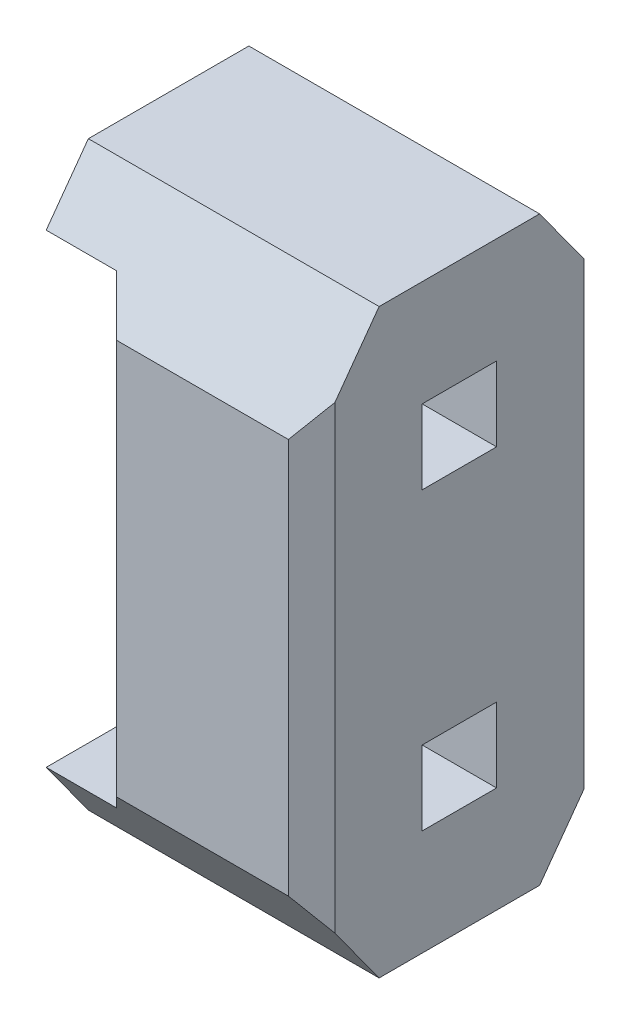
ISO-10303-21;
HEADER;
FILE_DESCRIPTION(('STEP AP214'),'2;1');
FILE_NAME('part.step','',(''),(''),'','','');
FILE_SCHEMA(('AUTOMOTIVE_DESIGN { 1 0 10303 214 1 1 1 1 }'));
ENDSEC;
DATA;
#1=APPLICATION_CONTEXT('core data for automotive mechanical design processes');
#2=APPLICATION_PROTOCOL_DEFINITION('international standard','automotive_design',2000,#1);
#3=PRODUCT_CONTEXT('',#1,'mechanical');
#4=PRODUCT('Part','Part','',(#3));
#5=PRODUCT_RELATED_PRODUCT_CATEGORY('part','',(#4));
#6=PRODUCT_DEFINITION_FORMATION('','',#4);
#7=PRODUCT_DEFINITION_CONTEXT('part definition',#1,'design');
#8=PRODUCT_DEFINITION('design','',#6,#7);
#9=PRODUCT_DEFINITION_SHAPE('','',#8);
#10=(LENGTH_UNIT() NAMED_UNIT(*) SI_UNIT(.MILLI.,.METRE.));
#11=(NAMED_UNIT(*) PLANE_ANGLE_UNIT() SI_UNIT($,.RADIAN.));
#12=(NAMED_UNIT(*) SI_UNIT($,.STERADIAN.) SOLID_ANGLE_UNIT());
#13=UNCERTAINTY_MEASURE_WITH_UNIT(LENGTH_MEASURE(1.E-05),#10,'distance_accuracy_value','');
#14=(GEOMETRIC_REPRESENTATION_CONTEXT(3) GLOBAL_UNCERTAINTY_ASSIGNED_CONTEXT((#13)) GLOBAL_UNIT_ASSIGNED_CONTEXT((#10,
#11,#12)) REPRESENTATION_CONTEXT('',''));
#15=CARTESIAN_POINT('',(0.,0.,0.));
#16=DIRECTION('',(0.,0.,1.));
#17=DIRECTION('',(1.,0.,0.));
#18=AXIS2_PLACEMENT_3D('',#15,#16,#17);
#19=CARTESIAN_POINT('',(1.25,4.6,-43.47));
#20=DIRECTION('',(0.,0.586967571460905,0.809610443394407));
#21=DIRECTION('',(0.,-0.809610443394407,0.586967571460905));
#22=AXIS2_PLACEMENT_3D('',#19,#20,#21);
#23=PLANE('',#22);
#24=DIRECTION('',(1.,0.,0.));
#25=VECTOR('',#24,1.);
#26=CARTESIAN_POINT('',(1.25,4.5,-43.3975));
#27=LINE('',#26,#25);
#28=CARTESIAN_POINT('',(0.,4.5,-43.3975));
#29=VERTEX_POINT('',#28);
#30=CARTESIAN_POINT('',(0.602500000000326,4.5,-43.3975000000001));
#31=VERTEX_POINT('',#30);
#32=EDGE_CURVE('E199',#29,#31,#27,.T.);
#33=ORIENTED_EDGE('',*,*,#32,.T.);
#34=DIRECTION('',(0.506207656348699,-0.698217457033982,0.506207656349603));
#35=VECTOR('',#34,1.);
#36=CARTESIAN_POINT('',(0.6025000000002,4.5,-43.3975));
#37=LINE('',#36,#35);
#38=CARTESIAN_POINT('',(0.819999999999671,4.2,-43.1799999999999));
#39=VERTEX_POINT('',#38);
#40=EDGE_CURVE('E197',#31,#39,#37,.T.);
#41=ORIENTED_EDGE('',*,*,#40,.T.);
#42=DIRECTION('',(1.,0.,0.));
#43=VECTOR('',#42,1.);
#44=CARTESIAN_POINT('',(1.25,4.19999999999999,-43.18));
#45=LINE('',#44,#43);
#46=CARTESIAN_POINT('',(2.30000000000012,4.2,-43.1799999999999));
#47=VERTEX_POINT('',#46);
#48=EDGE_CURVE('E20',#39,#47,#45,.T.);
#49=ORIENTED_EDGE('',*,*,#48,.T.);
#50=DIRECTION('',(0.506207656348957,0.698217457033858,-0.506207656349515));
#51=VECTOR('',#50,1.);
#52=CARTESIAN_POINT('',(2.3,4.19999999999999,-43.18));
#53=LINE('',#52,#51);
#54=CARTESIAN_POINT('',(2.49999999999988,4.47586206896592,-43.3800000000002));
#55=VERTEX_POINT('',#54);
#56=EDGE_CURVE('E181',#47,#55,#53,.T.);
#57=ORIENTED_EDGE('',*,*,#56,.T.);
#58=DIRECTION('',(0.,-0.809610443394407,0.586967571460905));
#59=VECTOR('',#58,1.);
#60=CARTESIAN_POINT('',(2.5,4.6,-43.47));
#61=LINE('',#60,#59);
#62=CARTESIAN_POINT('',(2.5,5.,-43.76));
#63=VERTEX_POINT('',#62);
#64=EDGE_CURVE('E188',#55,#63,#61,.F.);
#65=ORIENTED_EDGE('',*,*,#64,.T.);
#66=DIRECTION('',(1.,0.,0.));
#67=VECTOR('',#66,1.);
#68=CARTESIAN_POINT('',(1.25,5.,-43.76));
#69=LINE('',#68,#67);
#70=CARTESIAN_POINT('',(0.,5.,-43.76));
#71=VERTEX_POINT('',#70);
#72=EDGE_CURVE('E215',#71,#63,#69,.T.);
#73=ORIENTED_EDGE('',*,*,#72,.F.);
#74=DIRECTION('',(0.,-0.809610443394407,0.586967571460905));
#75=VECTOR('',#74,1.);
#76=CARTESIAN_POINT('',(0.,4.6,-43.47));
#77=LINE('',#76,#75);
#78=EDGE_CURVE('E207',#71,#29,#77,.T.);
#79=ORIENTED_EDGE('',*,*,#78,.T.);
#80=EDGE_LOOP('',(#33,#41,#49,#57,#65,#73,#79));
#81=FACE_BOUND('',#80,.T.);
#82=ADVANCED_FACE('F17',(#81),#23,.T.);
#83=CARTESIAN_POINT('',(1.25,4.6,-45.43));
#84=DIRECTION('',(0.,-0.586967571460905,0.809610443394407));
#85=DIRECTION('',(0.,-0.809610443394407,-0.586967571460905));
#86=AXIS2_PLACEMENT_3D('',#83,#84,#85);
#87=PLANE('',#86);
#88=DIRECTION('',(0.,-0.809610443394407,-0.586967571460905));
#89=VECTOR('',#88,1.);
#90=CARTESIAN_POINT('',(0.,4.6,-45.43));
#91=LINE('',#90,#89);
#92=CARTESIAN_POINT('',(0.,5.,-45.14));
#93=VERTEX_POINT('',#92);
#94=CARTESIAN_POINT('',(0.,4.5,-45.5025));
#95=VERTEX_POINT('',#94);
#96=EDGE_CURVE('E263',#93,#95,#91,.T.);
#97=ORIENTED_EDGE('',*,*,#96,.F.);
#98=DIRECTION('',(1.,0.,0.));
#99=VECTOR('',#98,1.);
#100=CARTESIAN_POINT('',(1.25,5.,-45.14));
#101=LINE('',#100,#99);
#102=CARTESIAN_POINT('',(2.5,5.,-45.14));
#103=VERTEX_POINT('',#102);
#104=EDGE_CURVE('E227',#103,#93,#101,.F.);
#105=ORIENTED_EDGE('',*,*,#104,.F.);
#106=DIRECTION('',(0.,-0.809610443394407,-0.586967571460905));
#107=VECTOR('',#106,1.);
#108=CARTESIAN_POINT('',(2.5,4.6,-45.43));
#109=LINE('',#108,#107);
#110=CARTESIAN_POINT('',(2.49999999999988,4.47586206896591,-45.5199999999998));
#111=VERTEX_POINT('',#110);
#112=EDGE_CURVE('E223',#111,#103,#109,.F.);
#113=ORIENTED_EDGE('',*,*,#112,.F.);
#114=DIRECTION('',(0.506207656348966,0.698217457033858,0.506207656349507));
#115=VECTOR('',#114,1.);
#116=CARTESIAN_POINT('',(2.3,4.19999999999999,-45.72));
#117=LINE('',#116,#115);
#118=CARTESIAN_POINT('',(2.30000000000012,4.2,-45.7200000000001));
#119=VERTEX_POINT('',#118);
#120=EDGE_CURVE('E266',#119,#111,#117,.T.);
#121=ORIENTED_EDGE('',*,*,#120,.F.);
#122=DIRECTION('',(1.,0.,0.));
#123=VECTOR('',#122,1.);
#124=CARTESIAN_POINT('',(1.25,4.19999999999999,-45.72));
#125=LINE('',#124,#123);
#126=CARTESIAN_POINT('',(0.819999999999671,4.2,-45.7200000000001));
#127=VERTEX_POINT('',#126);
#128=EDGE_CURVE('E205',#127,#119,#125,.T.);
#129=ORIENTED_EDGE('',*,*,#128,.F.);
#130=DIRECTION('',(0.506207656348699,-0.698217457033982,-0.506207656349603));
#131=VECTOR('',#130,1.);
#132=CARTESIAN_POINT('',(0.6025000000002,4.5,-45.5025));
#133=LINE('',#132,#131);
#134=CARTESIAN_POINT('',(0.602500000000326,4.5,-45.5024999999999));
#135=VERTEX_POINT('',#134);
#136=EDGE_CURVE('E203',#135,#127,#133,.T.);
#137=ORIENTED_EDGE('',*,*,#136,.F.);
#138=DIRECTION('',(1.,0.,0.));
#139=VECTOR('',#138,1.);
#140=CARTESIAN_POINT('',(1.25,4.5,-45.5025));
#141=LINE('',#140,#139);
#142=EDGE_CURVE('E261',#95,#135,#141,.T.);
#143=ORIENTED_EDGE('',*,*,#142,.F.);
#144=EDGE_LOOP('',(#97,#105,#113,#121,#129,#137,#143));
#145=FACE_BOUND('',#144,.T.);
#146=ADVANCED_FACE('F285',(#145),#87,.F.);
#147=CARTESIAN_POINT('',(1.25,0.4,-45.43));
#148=DIRECTION('',(0.,0.586967571460905,0.809610443394407));
#149=DIRECTION('',(0.,-0.809610443394407,0.586967571460905));
#150=AXIS2_PLACEMENT_3D('',#147,#148,#149);
#151=PLANE('',#150);
#152=DIRECTION('',(-0.506207656349411,0.698217457033645,-0.506207656349355));
#153=VECTOR('',#152,1.);
#154=CARTESIAN_POINT('',(2.5,0.5241379310345,-45.52));
#155=LINE('',#154,#153);
#156=CARTESIAN_POINT('',(2.49999999999988,0.5241379310345,-45.5199999999999));
#157=VERTEX_POINT('',#156);
#158=CARTESIAN_POINT('',(2.30000000000012,0.800000000000004,-45.7200000000001));
#159=VERTEX_POINT('',#158);
#160=EDGE_CURVE('E251',#157,#159,#155,.T.);
#161=ORIENTED_EDGE('',*,*,#160,.F.);
#162=DIRECTION('',(0.,-0.809610443394407,0.586967571460905));
#163=VECTOR('',#162,1.);
#164=CARTESIAN_POINT('',(2.5,0.4,-45.43));
#165=LINE('',#164,#163);
#166=CARTESIAN_POINT('',(2.5,0.,-45.14));
#167=VERTEX_POINT('',#166);
#168=EDGE_CURVE('E253',#167,#157,#165,.F.);
#169=ORIENTED_EDGE('',*,*,#168,.F.);
#170=DIRECTION('',(1.,0.,0.));
#171=VECTOR('',#170,1.);
#172=CARTESIAN_POINT('',(1.25,0.,-45.14));
#173=LINE('',#172,#171);
#174=CARTESIAN_POINT('',(0.,0.,-45.14));
#175=VERTEX_POINT('',#174);
#176=EDGE_CURVE('E288',#167,#175,#173,.F.);
#177=ORIENTED_EDGE('',*,*,#176,.T.);
#178=DIRECTION('',(0.,-0.809610443394407,0.586967571460905));
#179=VECTOR('',#178,1.);
#180=CARTESIAN_POINT('',(0.,0.4,-45.43));
#181=LINE('',#180,#179);
#182=CARTESIAN_POINT('',(0.,0.500000000000001,-45.5025));
#183=VERTEX_POINT('',#182);
#184=EDGE_CURVE('E255',#183,#175,#181,.T.);
#185=ORIENTED_EDGE('',*,*,#184,.F.);
#186=DIRECTION('',(1.,0.,0.));
#187=VECTOR('',#186,1.);
#188=CARTESIAN_POINT('',(1.25,0.500000000000003,-45.5025));
#189=LINE('',#188,#187);
#190=CARTESIAN_POINT('',(0.602500000000326,0.500000000000002,-45.5024999999999));
#191=VERTEX_POINT('',#190);
#192=EDGE_CURVE('E257',#191,#183,#189,.F.);
#193=ORIENTED_EDGE('',*,*,#192,.F.);
#194=DIRECTION('',(-0.506207656348698,-0.698217457033982,0.506207656349602));
#195=VECTOR('',#194,1.);
#196=CARTESIAN_POINT('',(0.8199999999998,0.800000000000008,-45.72));
#197=LINE('',#196,#195);
#198=CARTESIAN_POINT('',(0.819999999999671,0.800000000000004,-45.7200000000001));
#199=VERTEX_POINT('',#198);
#200=EDGE_CURVE('E259',#199,#191,#197,.T.);
#201=ORIENTED_EDGE('',*,*,#200,.F.);
#202=DIRECTION('',(1.,0.,0.));
#203=VECTOR('',#202,1.);
#204=CARTESIAN_POINT('',(1.25,0.800000000000008,-45.72));
#205=LINE('',#204,#203);
#206=EDGE_CURVE('E249',#159,#199,#205,.F.);
#207=ORIENTED_EDGE('',*,*,#206,.F.);
#208=EDGE_LOOP('',(#161,#169,#177,#185,#193,#201,#207));
#209=FACE_BOUND('',#208,.T.);
#210=ADVANCED_FACE('F431',(#209),#151,.F.);
#211=CARTESIAN_POINT('',(1.25,0.4,-43.47));
#212=DIRECTION('',(0.,-0.586967571460905,0.809610443394407));
#213=DIRECTION('',(0.,-0.809610443394407,-0.586967571460905));
#214=AXIS2_PLACEMENT_3D('',#211,#212,#213);
#215=PLANE('',#214);
#216=DIRECTION('',(1.,0.,0.));
#217=VECTOR('',#216,1.);
#218=CARTESIAN_POINT('',(1.25,0.800000000000008,-43.18));
#219=LINE('',#218,#217);
#220=CARTESIAN_POINT('',(2.30000000000012,0.800000000000004,-43.1799999999999));
#221=VERTEX_POINT('',#220);
#222=CARTESIAN_POINT('',(0.819999999999671,0.800000000000004,-43.1799999999999));
#223=VERTEX_POINT('',#222);
#224=EDGE_CURVE('E191',#221,#223,#219,.F.);
#225=ORIENTED_EDGE('',*,*,#224,.T.);
#226=DIRECTION('',(-0.506207656348698,-0.698217457033982,-0.506207656349602));
#227=VECTOR('',#226,1.);
#228=CARTESIAN_POINT('',(0.8199999999998,0.800000000000008,-43.18));
#229=LINE('',#228,#227);
#230=CARTESIAN_POINT('',(0.602500000000326,0.500000000000002,-43.3975000000001));
#231=VERTEX_POINT('',#230);
#232=EDGE_CURVE('E232',#223,#231,#229,.T.);
#233=ORIENTED_EDGE('',*,*,#232,.T.);
#234=DIRECTION('',(1.,0.,0.));
#235=VECTOR('',#234,1.);
#236=CARTESIAN_POINT('',(1.25,0.500000000000003,-43.3975));
#237=LINE('',#236,#235);
#238=CARTESIAN_POINT('',(0.,0.500000000000001,-43.3975));
#239=VERTEX_POINT('',#238);
#240=EDGE_CURVE('E246',#231,#239,#237,.F.);
#241=ORIENTED_EDGE('',*,*,#240,.T.);
#242=DIRECTION('',(0.,-0.809610443394407,-0.586967571460905));
#243=VECTOR('',#242,1.);
#244=CARTESIAN_POINT('',(0.,0.4,-43.47));
#245=LINE('',#244,#243);
#246=CARTESIAN_POINT('',(0.,0.,-43.76));
#247=VERTEX_POINT('',#246);
#248=EDGE_CURVE('E244',#239,#247,#245,.T.);
#249=ORIENTED_EDGE('',*,*,#248,.T.);
#250=DIRECTION('',(1.,0.,0.));
#251=VECTOR('',#250,1.);
#252=CARTESIAN_POINT('',(1.25,0.,-43.76));
#253=LINE('',#252,#251);
#254=CARTESIAN_POINT('',(2.5,0.,-43.76));
#255=VERTEX_POINT('',#254);
#256=EDGE_CURVE('E293',#247,#255,#253,.T.);
#257=ORIENTED_EDGE('',*,*,#256,.T.);
#258=DIRECTION('',(0.,-0.809610443394407,-0.586967571460905));
#259=VECTOR('',#258,1.);
#260=CARTESIAN_POINT('',(2.5,0.4,-43.47));
#261=LINE('',#260,#259);
#262=CARTESIAN_POINT('',(2.49999999999988,0.524137931034499,-43.3800000000001));
#263=VERTEX_POINT('',#262);
#264=EDGE_CURVE('E241',#255,#263,#261,.F.);
#265=ORIENTED_EDGE('',*,*,#264,.T.);
#266=DIRECTION('',(-0.506207656349409,0.698217457033648,0.506207656349353));
#267=VECTOR('',#266,1.);
#268=CARTESIAN_POINT('',(2.5,0.524137931034498,-43.38));
#269=LINE('',#268,#267);
#270=EDGE_CURVE('E239',#263,#221,#269,.T.);
#271=ORIENTED_EDGE('',*,*,#270,.T.);
#272=EDGE_LOOP('',(#225,#233,#241,#249,#257,#265,#271));
#273=FACE_BOUND('',#272,.T.);
#274=ADVANCED_FACE('F421',(#273),#215,.T.);
#275=CARTESIAN_POINT('',(1.25,5.,-44.45));
#276=DIRECTION('',(0.,1.,0.));
#277=DIRECTION('',(0.,0.,1.));
#278=AXIS2_PLACEMENT_3D('',#275,#276,#277);
#279=PLANE('',#278);
#280=ORIENTED_EDGE('',*,*,#104,.T.);
#281=DIRECTION('',(0.,0.,-1.));
#282=VECTOR('',#281,1.);
#283=CARTESIAN_POINT('',(0.,5.,-44.45));
#284=LINE('',#283,#282);
#285=EDGE_CURVE('E231',#93,#71,#284,.F.);
#286=ORIENTED_EDGE('',*,*,#285,.T.);
#287=ORIENTED_EDGE('',*,*,#72,.T.);
#288=DIRECTION('',(0.,0.,1.));
#289=VECTOR('',#288,1.);
#290=CARTESIAN_POINT('',(2.5,5.,-44.45));
#291=LINE('',#290,#289);
#292=EDGE_CURVE('E219',#63,#103,#291,.F.);
#293=ORIENTED_EDGE('',*,*,#292,.T.);
#294=EDGE_LOOP('',(#280,#286,#287,#293));
#295=FACE_BOUND('',#294,.T.);
#296=ADVANCED_FACE('F229',(#295),#279,.T.);
#297=CARTESIAN_POINT('',(1.25,0.,-44.45));
#298=DIRECTION('',(0.,1.,0.));
#299=DIRECTION('',(0.,0.,1.));
#300=AXIS2_PLACEMENT_3D('',#297,#298,#299);
#301=PLANE('',#300);
#302=DIRECTION('',(0.,0.,-1.));
#303=VECTOR('',#302,1.);
#304=CARTESIAN_POINT('',(0.,0.,-44.45));
#305=LINE('',#304,#303);
#306=EDGE_CURVE('E297',#247,#175,#305,.T.);
#307=ORIENTED_EDGE('',*,*,#306,.T.);
#308=ORIENTED_EDGE('',*,*,#176,.F.);
#309=DIRECTION('',(0.,0.,1.));
#310=VECTOR('',#309,1.);
#311=CARTESIAN_POINT('',(2.5,0.,-44.45));
#312=LINE('',#311,#310);
#313=EDGE_CURVE('E287',#255,#167,#312,.F.);
#314=ORIENTED_EDGE('',*,*,#313,.F.);
#315=ORIENTED_EDGE('',*,*,#256,.F.);
#316=EDGE_LOOP('',(#307,#308,#314,#315));
#317=FACE_BOUND('',#316,.T.);
#318=ADVANCED_FACE('F428',(#317),#301,.F.);
#319=CARTESIAN_POINT('',(0.,4.75,-44.45));
#320=DIRECTION('',(1.,0.,0.));
#321=DIRECTION('',(0.,0.,-1.));
#322=AXIS2_PLACEMENT_3D('',#319,#320,#321);
#323=PLANE('',#322);
#324=ORIENTED_EDGE('',*,*,#285,.F.);
#325=ORIENTED_EDGE('',*,*,#96,.T.);
#326=DIRECTION('',(0.,0.,1.));
#327=VECTOR('',#326,1.);
#328=CARTESIAN_POINT('',(0.,4.5,-44.45));
#329=LINE('',#328,#327);
#330=EDGE_CURVE('E307',#95,#29,#329,.T.);
#331=ORIENTED_EDGE('',*,*,#330,.T.);
#332=ORIENTED_EDGE('',*,*,#78,.F.);
#333=EDGE_LOOP('',(#324,#325,#331,#332));
#334=FACE_BOUND('',#333,.T.);
#335=ADVANCED_FACE('F441',(#334),#323,.F.);
#336=CARTESIAN_POINT('',(0.,0.25,-44.45));
#337=DIRECTION('',(1.,0.,0.));
#338=DIRECTION('',(0.,0.,-1.));
#339=AXIS2_PLACEMENT_3D('',#336,#337,#338);
#340=PLANE('',#339);
#341=ORIENTED_EDGE('',*,*,#306,.F.);
#342=ORIENTED_EDGE('',*,*,#248,.F.);
#343=DIRECTION('',(0.,0.,1.));
#344=VECTOR('',#343,1.);
#345=CARTESIAN_POINT('',(0.,0.5,-44.45));
#346=LINE('',#345,#344);
#347=EDGE_CURVE('E315',#183,#239,#346,.T.);
#348=ORIENTED_EDGE('',*,*,#347,.F.);
#349=ORIENTED_EDGE('',*,*,#184,.T.);
#350=EDGE_LOOP('',(#341,#342,#348,#349));
#351=FACE_BOUND('',#350,.T.);
#352=ADVANCED_FACE('F443',(#351),#340,.F.);
#353=CARTESIAN_POINT('',(1.55,3.45,-44.45));
#354=DIRECTION('',(0.,1.,0.));
#355=DIRECTION('',(0.,0.,1.));
#356=AXIS2_PLACEMENT_3D('',#353,#354,#355);
#357=PLANE('',#356);
#358=DIRECTION('',(1.,0.,0.));
#359=VECTOR('',#358,1.);
#360=CARTESIAN_POINT('',(1.55,3.45,-44.77));
#361=LINE('',#360,#359);
#362=CARTESIAN_POINT('',(0.6,3.45,-44.77));
#363=VERTEX_POINT('',#362);
#364=CARTESIAN_POINT('',(2.5,3.45,-44.77));
#365=VERTEX_POINT('',#364);
#366=EDGE_CURVE('E332',#363,#365,#361,.T.);
#367=ORIENTED_EDGE('',*,*,#366,.F.);
#368=DIRECTION('',(0.,0.,1.));
#369=VECTOR('',#368,1.);
#370=CARTESIAN_POINT('',(0.6,3.45,-44.45));
#371=LINE('',#370,#369);
#372=CARTESIAN_POINT('',(0.6,3.45,-44.13));
#373=VERTEX_POINT('',#372);
#374=EDGE_CURVE('E302',#363,#373,#371,.T.);
#375=ORIENTED_EDGE('',*,*,#374,.T.);
#376=DIRECTION('',(1.,0.,0.));
#377=VECTOR('',#376,1.);
#378=CARTESIAN_POINT('',(1.55,3.45,-44.13));
#379=LINE('',#378,#377);
#380=CARTESIAN_POINT('',(2.5,3.45,-44.13));
#381=VERTEX_POINT('',#380);
#382=EDGE_CURVE('E327',#373,#381,#379,.T.);
#383=ORIENTED_EDGE('',*,*,#382,.T.);
#384=DIRECTION('',(0.,0.,1.));
#385=VECTOR('',#384,1.);
#386=CARTESIAN_POINT('',(2.5,3.45,-44.45));
#387=LINE('',#386,#385);
#388=EDGE_CURVE('E300',#381,#365,#387,.F.);
#389=ORIENTED_EDGE('',*,*,#388,.T.);
#390=EDGE_LOOP('',(#367,#375,#383,#389));
#391=FACE_BOUND('',#390,.T.);
#392=ADVANCED_FACE('F398',(#391),#357,.T.);
#393=CARTESIAN_POINT('',(0.71,2.5,-45.61));
#394=DIRECTION('',(0.707106781190498,0.,0.707106781182598));
#395=DIRECTION('',(0.707106781182598,0.,-0.707106781190498));
#396=AXIS2_PLACEMENT_3D('',#393,#394,#395);
#397=PLANE('',#396);
#398=ORIENTED_EDGE('',*,*,#200,.T.);
#399=DIRECTION('',(0.70710678118618,0.,-0.707106781186916));
#400=VECTOR('',#399,1.);
#401=CARTESIAN_POINT('',(0.6000000000002,0.5,-45.5));
#402=LINE('',#401,#400);
#403=CARTESIAN_POINT('',(0.600000000000408,0.5,-45.4999999999997));
#404=VERTEX_POINT('',#403);
#405=EDGE_CURVE('E312',#404,#191,#402,.T.);
#406=ORIENTED_EDGE('',*,*,#405,.F.);
#407=DIRECTION('',(0.,1.,0.));
#408=VECTOR('',#407,1.);
#409=CARTESIAN_POINT('',(0.6,2.5,-45.5));
#410=LINE('',#409,#408);
#411=CARTESIAN_POINT('',(0.600000000000408,4.5,-45.4999999999997));
#412=VERTEX_POINT('',#411);
#413=EDGE_CURVE('E337',#404,#412,#410,.T.);
#414=ORIENTED_EDGE('',*,*,#413,.T.);
#415=DIRECTION('',(0.70710678118618,0.,-0.707106781186916));
#416=VECTOR('',#415,1.);
#417=CARTESIAN_POINT('',(0.6000000000002,4.5,-45.5));
#418=LINE('',#417,#416);
#419=EDGE_CURVE('E304',#412,#135,#418,.T.);
#420=ORIENTED_EDGE('',*,*,#419,.T.);
#421=ORIENTED_EDGE('',*,*,#136,.T.);
#422=DIRECTION('',(0.,1.,0.));
#423=VECTOR('',#422,1.);
#424=CARTESIAN_POINT('',(0.8199999999998,2.5,-45.72));
#425=LINE('',#424,#423);
#426=EDGE_CURVE('E275',#127,#199,#425,.F.);
#427=ORIENTED_EDGE('',*,*,#426,.T.);
#428=EDGE_LOOP('',(#398,#406,#414,#420,#421,#427));
#429=FACE_BOUND('',#428,.T.);
#430=ADVANCED_FACE('F435',(#429),#397,.F.);
#431=CARTESIAN_POINT('',(0.30125,4.5,-44.45));
#432=DIRECTION('',(0.,1.,0.));
#433=DIRECTION('',(0.,0.,1.));
#434=AXIS2_PLACEMENT_3D('',#431,#432,#433);
#435=PLANE('',#434);
#436=ORIENTED_EDGE('',*,*,#142,.T.);
#437=ORIENTED_EDGE('',*,*,#419,.F.);
#438=DIRECTION('',(0.,0.,-1.));
#439=VECTOR('',#438,1.);
#440=CARTESIAN_POINT('',(0.6,4.5,-44.45));
#441=LINE('',#440,#439);
#442=CARTESIAN_POINT('',(0.600000000000279,4.5,-43.4000000000001));
#443=VERTEX_POINT('',#442);
#444=EDGE_CURVE('E339',#412,#443,#441,.F.);
#445=ORIENTED_EDGE('',*,*,#444,.T.);
#446=DIRECTION('',(-0.707106781182598,0.,-0.707106781190498));
#447=VECTOR('',#446,1.);
#448=CARTESIAN_POINT('',(0.71,4.5,-43.29));
#449=LINE('',#448,#447);
#450=EDGE_CURVE('E310',#443,#31,#449,.F.);
#451=ORIENTED_EDGE('',*,*,#450,.T.);
#452=ORIENTED_EDGE('',*,*,#32,.F.);
#453=ORIENTED_EDGE('',*,*,#330,.F.);
#454=EDGE_LOOP('',(#436,#437,#445,#451,#452,#453));
#455=FACE_BOUND('',#454,.T.);
#456=ADVANCED_FACE('F439',(#455),#435,.F.);
#457=CARTESIAN_POINT('',(0.71,2.5,-43.29));
#458=DIRECTION('',(0.707106781190498,0.,-0.707106781182598));
#459=DIRECTION('',(-0.707106781182598,0.,-0.707106781190498));
#460=AXIS2_PLACEMENT_3D('',#457,#458,#459);
#461=PLANE('',#460);
#462=ORIENTED_EDGE('',*,*,#232,.F.);
#463=DIRECTION('',(0.,1.,0.));
#464=VECTOR('',#463,1.);
#465=CARTESIAN_POINT('',(0.8199999999998,2.5,-43.18));
#466=LINE('',#465,#464);
#467=EDGE_CURVE('E325',#39,#223,#466,.F.);
#468=ORIENTED_EDGE('',*,*,#467,.F.);
#469=ORIENTED_EDGE('',*,*,#40,.F.);
#470=ORIENTED_EDGE('',*,*,#450,.F.);
#471=DIRECTION('',(0.,1.,0.));
#472=VECTOR('',#471,1.);
#473=CARTESIAN_POINT('',(0.6,2.5,-43.4));
#474=LINE('',#473,#472);
#475=CARTESIAN_POINT('',(0.600000000000408,0.5,-43.4000000000003));
#476=VERTEX_POINT('',#475);
#477=EDGE_CURVE('E341',#443,#476,#474,.F.);
#478=ORIENTED_EDGE('',*,*,#477,.T.);
#479=DIRECTION('',(-0.70710678118618,0.,-0.707106781186916));
#480=VECTOR('',#479,1.);
#481=CARTESIAN_POINT('',(0.6025000000002,0.5,-43.3975));
#482=LINE('',#481,#480);
#483=EDGE_CURVE('E318',#231,#476,#482,.T.);
#484=ORIENTED_EDGE('',*,*,#483,.F.);
#485=EDGE_LOOP('',(#462,#468,#469,#470,#478,#484));
#486=FACE_BOUND('',#485,.T.);
#487=ADVANCED_FACE('F416',(#486),#461,.F.);
#488=CARTESIAN_POINT('',(0.30125,0.5,-44.45));
#489=DIRECTION('',(0.,1.,0.));
#490=DIRECTION('',(0.,0.,1.));
#491=AXIS2_PLACEMENT_3D('',#488,#489,#490);
#492=PLANE('',#491);
#493=ORIENTED_EDGE('',*,*,#483,.T.);
#494=DIRECTION('',(0.,0.,-1.));
#495=VECTOR('',#494,1.);
#496=CARTESIAN_POINT('',(0.6,0.5,-44.45));
#497=LINE('',#496,#495);
#498=EDGE_CURVE('E343',#476,#404,#497,.T.);
#499=ORIENTED_EDGE('',*,*,#498,.T.);
#500=ORIENTED_EDGE('',*,*,#405,.T.);
#501=ORIENTED_EDGE('',*,*,#192,.T.);
#502=ORIENTED_EDGE('',*,*,#347,.T.);
#503=ORIENTED_EDGE('',*,*,#240,.F.);
#504=EDGE_LOOP('',(#493,#499,#500,#501,#502,#503));
#505=FACE_BOUND('',#504,.T.);
#506=ADVANCED_FACE('F418',(#505),#492,.T.);
#507=CARTESIAN_POINT('',(1.55,1.23,-44.77));
#508=DIRECTION('',(0.,0.,1.));
#509=DIRECTION('',(1.,0.,0.));
#510=AXIS2_PLACEMENT_3D('',#507,#508,#509);
#511=PLANE('',#510);
#512=DIRECTION('',(1.,0.,0.));
#513=VECTOR('',#512,1.);
#514=CARTESIAN_POINT('',(1.55,1.55,-44.77));
#515=LINE('',#514,#513);
#516=CARTESIAN_POINT('',(2.5,1.55,-44.77));
#517=VERTEX_POINT('',#516);
#518=CARTESIAN_POINT('',(0.6,1.55,-44.77));
#519=VERTEX_POINT('',#518);
#520=EDGE_CURVE('E283',#517,#519,#515,.F.);
#521=ORIENTED_EDGE('',*,*,#520,.T.);
#522=DIRECTION('',(0.,1.,0.));
#523=VECTOR('',#522,1.);
#524=CARTESIAN_POINT('',(0.6,2.5,-44.77));
#525=LINE('',#524,#523);
#526=CARTESIAN_POINT('',(0.6,0.91,-44.77));
#527=VERTEX_POINT('',#526);
#528=EDGE_CURVE('E346',#519,#527,#525,.F.);
#529=ORIENTED_EDGE('',*,*,#528,.T.);
#530=DIRECTION('',(1.,0.,0.));
#531=VECTOR('',#530,1.);
#532=CARTESIAN_POINT('',(1.55,0.91,-44.77));
#533=LINE('',#532,#531);
#534=CARTESIAN_POINT('',(2.5,0.91,-44.77));
#535=VERTEX_POINT('',#534);
#536=EDGE_CURVE('E354',#535,#527,#533,.F.);
#537=ORIENTED_EDGE('',*,*,#536,.F.);
#538=DIRECTION('',(0.,1.,0.));
#539=VECTOR('',#538,1.);
#540=CARTESIAN_POINT('',(2.5,1.23,-44.77));
#541=LINE('',#540,#539);
#542=EDGE_CURVE('E321',#535,#517,#541,.T.);
#543=ORIENTED_EDGE('',*,*,#542,.T.);
#544=EDGE_LOOP('',(#521,#529,#537,#543));
#545=FACE_BOUND('',#544,.T.);
#546=ADVANCED_FACE('F483',(#545),#511,.T.);
#547=CARTESIAN_POINT('',(1.56,2.5,-45.72));
#548=DIRECTION('',(0.,0.,1.));
#549=DIRECTION('',(1.,0.,0.));
#550=AXIS2_PLACEMENT_3D('',#547,#548,#549);
#551=PLANE('',#550);
#552=DIRECTION('',(0.,1.,0.));
#553=VECTOR('',#552,1.);
#554=CARTESIAN_POINT('',(2.30000000000047,2.5,-45.7200000000005));
#555=LINE('',#554,#553);
#556=EDGE_CURVE('E193',#159,#119,#555,.T.);
#557=ORIENTED_EDGE('',*,*,#556,.F.);
#558=ORIENTED_EDGE('',*,*,#206,.T.);
#559=ORIENTED_EDGE('',*,*,#426,.F.);
#560=ORIENTED_EDGE('',*,*,#128,.T.);
#561=EDGE_LOOP('',(#557,#558,#559,#560));
#562=FACE_BOUND('',#561,.T.);
#563=ADVANCED_FACE('F272',(#562),#551,.F.);
#564=CARTESIAN_POINT('',(1.56,2.5,-43.18));
#565=DIRECTION('',(0.,0.,1.));
#566=DIRECTION('',(1.,0.,0.));
#567=AXIS2_PLACEMENT_3D('',#564,#565,#566);
#568=PLANE('',#567);
#569=ORIENTED_EDGE('',*,*,#48,.F.);
#570=ORIENTED_EDGE('',*,*,#467,.T.);
#571=ORIENTED_EDGE('',*,*,#224,.F.);
#572=DIRECTION('',(0.,1.,0.));
#573=VECTOR('',#572,1.);
#574=CARTESIAN_POINT('',(2.30000000000047,2.5,-43.1799999999995));
#575=LINE('',#574,#573);
#576=EDGE_CURVE('E183',#47,#221,#575,.F.);
#577=ORIENTED_EDGE('',*,*,#576,.F.);
#578=EDGE_LOOP('',(#569,#570,#571,#577));
#579=FACE_BOUND('',#578,.T.);
#580=ADVANCED_FACE('F189',(#579),#568,.T.);
#581=CARTESIAN_POINT('',(1.55,3.77,-44.13));
#582=DIRECTION('',(0.,0.,1.));
#583=DIRECTION('',(1.,0.,0.));
#584=AXIS2_PLACEMENT_3D('',#581,#582,#583);
#585=PLANE('',#584);
#586=DIRECTION('',(0.,1.,0.));
#587=VECTOR('',#586,1.);
#588=CARTESIAN_POINT('',(2.5,3.77,-44.13));
#589=LINE('',#588,#587);
#590=CARTESIAN_POINT('',(2.5,4.09,-44.13));
#591=VERTEX_POINT('',#590);
#592=EDGE_CURVE('E330',#381,#591,#589,.T.);
#593=ORIENTED_EDGE('',*,*,#592,.F.);
#594=ORIENTED_EDGE('',*,*,#382,.F.);
#595=DIRECTION('',(0.,1.,0.));
#596=VECTOR('',#595,1.);
#597=CARTESIAN_POINT('',(0.6,2.5,-44.13));
#598=LINE('',#597,#596);
#599=CARTESIAN_POINT('',(0.6,4.09,-44.13));
#600=VERTEX_POINT('',#599);
#601=EDGE_CURVE('E351',#373,#600,#598,.T.);
#602=ORIENTED_EDGE('',*,*,#601,.T.);
#603=DIRECTION('',(1.,0.,0.));
#604=VECTOR('',#603,1.);
#605=CARTESIAN_POINT('',(1.55,4.09,-44.13));
#606=LINE('',#605,#604);
#607=EDGE_CURVE('E368',#600,#591,#606,.T.);
#608=ORIENTED_EDGE('',*,*,#607,.T.);
#609=EDGE_LOOP('',(#593,#594,#602,#608));
#610=FACE_BOUND('',#609,.T.);
#611=ADVANCED_FACE('F402',(#610),#585,.F.);
#612=CARTESIAN_POINT('',(1.55,3.77,-44.77));
#613=DIRECTION('',(0.,0.,1.));
#614=DIRECTION('',(1.,0.,0.));
#615=AXIS2_PLACEMENT_3D('',#612,#613,#614);
#616=PLANE('',#615);
#617=DIRECTION('',(1.,0.,0.));
#618=VECTOR('',#617,1.);
#619=CARTESIAN_POINT('',(1.55,4.09,-44.77));
#620=LINE('',#619,#618);
#621=CARTESIAN_POINT('',(2.5,4.09,-44.77));
#622=VERTEX_POINT('',#621);
#623=CARTESIAN_POINT('',(0.6,4.09,-44.77));
#624=VERTEX_POINT('',#623);
#625=EDGE_CURVE('E371',#622,#624,#620,.F.);
#626=ORIENTED_EDGE('',*,*,#625,.T.);
#627=DIRECTION('',(0.,1.,0.));
#628=VECTOR('',#627,1.);
#629=CARTESIAN_POINT('',(0.6,2.5,-44.77));
#630=LINE('',#629,#628);
#631=EDGE_CURVE('E348',#624,#363,#630,.F.);
#632=ORIENTED_EDGE('',*,*,#631,.T.);
#633=ORIENTED_EDGE('',*,*,#366,.T.);
#634=DIRECTION('',(0.,1.,0.));
#635=VECTOR('',#634,1.);
#636=CARTESIAN_POINT('',(2.5,3.77,-44.77));
#637=LINE('',#636,#635);
#638=EDGE_CURVE('E335',#365,#622,#637,.T.);
#639=ORIENTED_EDGE('',*,*,#638,.T.);
#640=EDGE_LOOP('',(#626,#632,#633,#639));
#641=FACE_BOUND('',#640,.T.);
#642=ADVANCED_FACE('F395',(#641),#616,.T.);
#643=CARTESIAN_POINT('',(0.6,2.5,-44.45));
#644=DIRECTION('',(1.,0.,0.));
#645=DIRECTION('',(0.,0.,-1.));
#646=AXIS2_PLACEMENT_3D('',#643,#644,#645);
#647=PLANE('',#646);
#648=ORIENTED_EDGE('',*,*,#374,.F.);
#649=ORIENTED_EDGE('',*,*,#631,.F.);
#650=DIRECTION('',(0.,0.,1.));
#651=VECTOR('',#650,1.);
#652=CARTESIAN_POINT('',(0.6,4.09,-44.45));
#653=LINE('',#652,#651);
#654=EDGE_CURVE('E192',#624,#600,#653,.T.);
#655=ORIENTED_EDGE('',*,*,#654,.T.);
#656=ORIENTED_EDGE('',*,*,#601,.F.);
#657=EDGE_LOOP('',(#648,#649,#655,#656));
#658=FACE_BOUND('',#657,.T.);
#659=ORIENTED_EDGE('',*,*,#528,.F.);
#660=DIRECTION('',(0.,0.,1.));
#661=VECTOR('',#660,1.);
#662=CARTESIAN_POINT('',(0.6,1.55,-44.45));
#663=LINE('',#662,#661);
#664=CARTESIAN_POINT('',(0.6,1.55,-44.13));
#665=VERTEX_POINT('',#664);
#666=EDGE_CURVE('E360',#519,#665,#663,.T.);
#667=ORIENTED_EDGE('',*,*,#666,.T.);
#668=DIRECTION('',(0.,1.,0.));
#669=VECTOR('',#668,1.);
#670=CARTESIAN_POINT('',(0.6,1.23,-44.13));
#671=LINE('',#670,#669);
#672=CARTESIAN_POINT('',(0.6,0.91,-44.13));
#673=VERTEX_POINT('',#672);
#674=EDGE_CURVE('E374',#665,#673,#671,.F.);
#675=ORIENTED_EDGE('',*,*,#674,.T.);
#676=DIRECTION('',(0.,0.,1.));
#677=VECTOR('',#676,1.);
#678=CARTESIAN_POINT('',(0.6,0.91,-44.45));
#679=LINE('',#678,#677);
#680=EDGE_CURVE('E357',#527,#673,#679,.T.);
#681=ORIENTED_EDGE('',*,*,#680,.F.);
#682=EDGE_LOOP('',(#659,#667,#675,#681));
#683=FACE_BOUND('',#682,.T.);
#684=ORIENTED_EDGE('',*,*,#477,.F.);
#685=ORIENTED_EDGE('',*,*,#444,.F.);
#686=ORIENTED_EDGE('',*,*,#413,.F.);
#687=ORIENTED_EDGE('',*,*,#498,.F.);
#688=EDGE_LOOP('',(#684,#685,#686,#687));
#689=FACE_BOUND('',#688,.T.);
#690=ADVANCED_FACE('F404',(#658,#683,#689),#647,.F.);
#691=CARTESIAN_POINT('',(1.55,0.91,-44.45));
#692=DIRECTION('',(0.,1.,0.));
#693=DIRECTION('',(0.,0.,1.));
#694=AXIS2_PLACEMENT_3D('',#691,#692,#693);
#695=PLANE('',#694);
#696=ORIENTED_EDGE('',*,*,#536,.T.);
#697=ORIENTED_EDGE('',*,*,#680,.T.);
#698=DIRECTION('',(1.,0.,0.));
#699=VECTOR('',#698,1.);
#700=CARTESIAN_POINT('',(1.55,0.91,-44.13));
#701=LINE('',#700,#699);
#702=CARTESIAN_POINT('',(2.5,0.91,-44.13));
#703=VERTEX_POINT('',#702);
#704=EDGE_CURVE('E376',#673,#703,#701,.T.);
#705=ORIENTED_EDGE('',*,*,#704,.T.);
#706=DIRECTION('',(0.,0.,1.));
#707=VECTOR('',#706,1.);
#708=CARTESIAN_POINT('',(2.5,0.91,-44.45));
#709=LINE('',#708,#707);
#710=EDGE_CURVE('E34',#703,#535,#709,.F.);
#711=ORIENTED_EDGE('',*,*,#710,.T.);
#712=EDGE_LOOP('',(#696,#697,#705,#711));
#713=FACE_BOUND('',#712,.T.);
#714=ADVANCED_FACE('F407',(#713),#695,.T.);
#715=CARTESIAN_POINT('',(1.55,1.55,-44.45));
#716=DIRECTION('',(0.,1.,0.));
#717=DIRECTION('',(0.,0.,1.));
#718=AXIS2_PLACEMENT_3D('',#715,#716,#717);
#719=PLANE('',#718);
#720=DIRECTION('',(0.,0.,1.));
#721=VECTOR('',#720,1.);
#722=CARTESIAN_POINT('',(2.5,1.55,-44.45));
#723=LINE('',#722,#721);
#724=CARTESIAN_POINT('',(2.5,1.55,-44.13));
#725=VERTEX_POINT('',#724);
#726=EDGE_CURVE('E362',#725,#517,#723,.F.);
#727=ORIENTED_EDGE('',*,*,#726,.F.);
#728=DIRECTION('',(1.,0.,0.));
#729=VECTOR('',#728,1.);
#730=CARTESIAN_POINT('',(1.55,1.55,-44.13));
#731=LINE('',#730,#729);
#732=EDGE_CURVE('E378',#725,#665,#731,.F.);
#733=ORIENTED_EDGE('',*,*,#732,.T.);
#734=ORIENTED_EDGE('',*,*,#666,.F.);
#735=ORIENTED_EDGE('',*,*,#520,.F.);
#736=EDGE_LOOP('',(#727,#733,#734,#735));
#737=FACE_BOUND('',#736,.T.);
#738=ADVANCED_FACE('F468',(#737),#719,.F.);
#739=CARTESIAN_POINT('',(2.4,2.5,-45.62));
#740=DIRECTION('',(0.707106781189898,0.,-0.707106781183198));
#741=DIRECTION('',(-0.707106781183198,0.,-0.707106781189898));
#742=AXIS2_PLACEMENT_3D('',#739,#740,#741);
#743=PLANE('',#742);
#744=DIRECTION('',(0.,1.,0.));
#745=VECTOR('',#744,1.);
#746=CARTESIAN_POINT('',(2.5,2.5,-45.52));
#747=LINE('',#746,#745);
#748=EDGE_CURVE('E381',#157,#111,#747,.T.);
#749=ORIENTED_EDGE('',*,*,#748,.F.);
#750=ORIENTED_EDGE('',*,*,#160,.T.);
#751=ORIENTED_EDGE('',*,*,#556,.T.);
#752=ORIENTED_EDGE('',*,*,#120,.T.);
#753=EDGE_LOOP('',(#749,#750,#751,#752));
#754=FACE_BOUND('',#753,.T.);
#755=ADVANCED_FACE('F281',(#754),#743,.T.);
#756=CARTESIAN_POINT('',(2.4,2.5,-43.28));
#757=DIRECTION('',(0.707106781189898,0.,0.707106781183198));
#758=DIRECTION('',(0.707106781183198,0.,-0.707106781189898));
#759=AXIS2_PLACEMENT_3D('',#756,#757,#758);
#760=PLANE('',#759);
#761=DIRECTION('',(0.,1.,0.));
#762=VECTOR('',#761,1.);
#763=CARTESIAN_POINT('',(2.5,2.5,-43.38));
#764=LINE('',#763,#762);
#765=EDGE_CURVE('E186',#55,#263,#764,.F.);
#766=ORIENTED_EDGE('',*,*,#765,.F.);
#767=ORIENTED_EDGE('',*,*,#56,.F.);
#768=ORIENTED_EDGE('',*,*,#576,.T.);
#769=ORIENTED_EDGE('',*,*,#270,.F.);
#770=EDGE_LOOP('',(#766,#767,#768,#769));
#771=FACE_BOUND('',#770,.T.);
#772=ADVANCED_FACE('F182',(#771),#760,.T.);
#773=CARTESIAN_POINT('',(1.55,4.09,-44.45));
#774=DIRECTION('',(0.,1.,0.));
#775=DIRECTION('',(0.,0.,1.));
#776=AXIS2_PLACEMENT_3D('',#773,#774,#775);
#777=PLANE('',#776);
#778=DIRECTION('',(0.,0.,-1.));
#779=VECTOR('',#778,1.);
#780=CARTESIAN_POINT('',(2.5,4.09,-44.45));
#781=LINE('',#780,#779);
#782=EDGE_CURVE('E26',#591,#622,#781,.T.);
#783=ORIENTED_EDGE('',*,*,#782,.F.);
#784=ORIENTED_EDGE('',*,*,#607,.F.);
#785=ORIENTED_EDGE('',*,*,#654,.F.);
#786=ORIENTED_EDGE('',*,*,#625,.F.);
#787=EDGE_LOOP('',(#783,#784,#785,#786));
#788=FACE_BOUND('',#787,.T.);
#789=ADVANCED_FACE('F392',(#788),#777,.F.);
#790=CARTESIAN_POINT('',(1.55,1.23,-44.13));
#791=DIRECTION('',(0.,0.,1.));
#792=DIRECTION('',(1.,0.,0.));
#793=AXIS2_PLACEMENT_3D('',#790,#791,#792);
#794=PLANE('',#793);
#795=DIRECTION('',(0.,1.,0.));
#796=VECTOR('',#795,1.);
#797=CARTESIAN_POINT('',(2.5,2.5,-44.13));
#798=LINE('',#797,#796);
#799=EDGE_CURVE('E11',#703,#725,#798,.T.);
#800=ORIENTED_EDGE('',*,*,#799,.F.);
#801=ORIENTED_EDGE('',*,*,#704,.F.);
#802=ORIENTED_EDGE('',*,*,#674,.F.);
#803=ORIENTED_EDGE('',*,*,#732,.F.);
#804=EDGE_LOOP('',(#800,#801,#802,#803));
#805=FACE_BOUND('',#804,.T.);
#806=ADVANCED_FACE('F454',(#805),#794,.F.);
#807=CARTESIAN_POINT('',(2.5,2.5,-44.45));
#808=DIRECTION('',(1.,0.,0.));
#809=DIRECTION('',(0.,0.,-1.));
#810=AXIS2_PLACEMENT_3D('',#807,#808,#809);
#811=PLANE('',#810);
#812=ORIENTED_EDGE('',*,*,#710,.F.);
#813=ORIENTED_EDGE('',*,*,#799,.T.);
#814=ORIENTED_EDGE('',*,*,#726,.T.);
#815=ORIENTED_EDGE('',*,*,#542,.F.);
#816=EDGE_LOOP('',(#812,#813,#814,#815));
#817=FACE_BOUND('',#816,.T.);
#818=ORIENTED_EDGE('',*,*,#592,.T.);
#819=ORIENTED_EDGE('',*,*,#782,.T.);
#820=ORIENTED_EDGE('',*,*,#638,.F.);
#821=ORIENTED_EDGE('',*,*,#388,.F.);
#822=EDGE_LOOP('',(#818,#819,#820,#821));
#823=FACE_BOUND('',#822,.T.);
#824=ORIENTED_EDGE('',*,*,#64,.F.);
#825=ORIENTED_EDGE('',*,*,#765,.T.);
#826=ORIENTED_EDGE('',*,*,#264,.F.);
#827=ORIENTED_EDGE('',*,*,#313,.T.);
#828=ORIENTED_EDGE('',*,*,#168,.T.);
#829=ORIENTED_EDGE('',*,*,#748,.T.);
#830=ORIENTED_EDGE('',*,*,#112,.T.);
#831=ORIENTED_EDGE('',*,*,#292,.F.);
#832=EDGE_LOOP('',(#824,#825,#826,#827,#828,#829,#830,#831));
#833=FACE_BOUND('',#832,.T.);
#834=ADVANCED_FACE('F220',(#817,#823,#833),#811,.T.);
#835=CLOSED_SHELL('',(#82,#146,#210,#274,#296,#318,#335,#352,#392,#430,#456,#487,#506,#546,#563,
#580,#611,#642,#690,#714,#738,#755,#772,#789,#806,#834));
#836=MANIFOLD_SOLID_BREP('B1',#835);
#837=ADVANCED_BREP_SHAPE_REPRESENTATION('',(#18,#836),#14);
#838=SHAPE_DEFINITION_REPRESENTATION(#9,#837);
ENDSEC;
END-ISO-10303-21;
